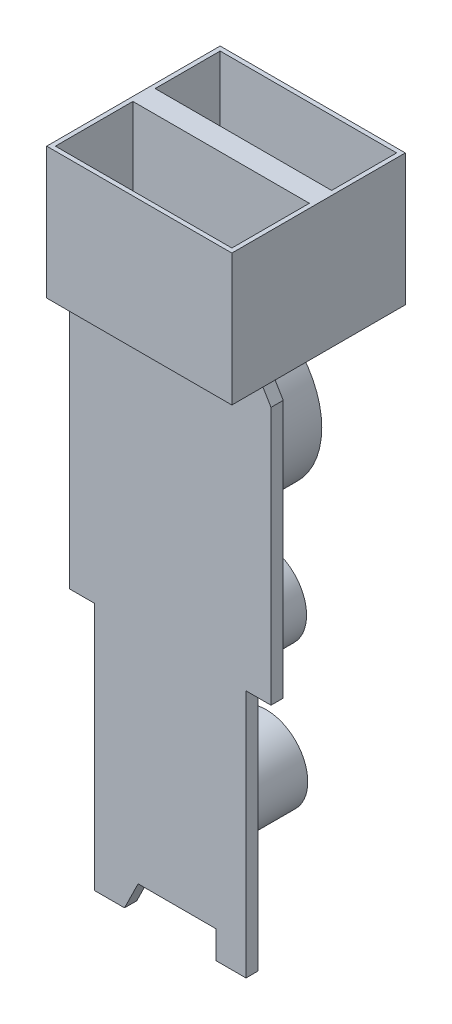
ISO-10303-21;
HEADER;
FILE_DESCRIPTION(('STEP AP214'),'2;1');
FILE_NAME('part.step','',(''),(''),'','','');
FILE_SCHEMA(('AUTOMOTIVE_DESIGN { 1 0 10303 214 1 1 1 1 }'));
ENDSEC;
DATA;
#1=APPLICATION_CONTEXT('core data for automotive mechanical design processes');
#2=APPLICATION_PROTOCOL_DEFINITION('international standard','automotive_design',2000,#1);
#3=PRODUCT_CONTEXT('',#1,'mechanical');
#4=PRODUCT('Part','Part','',(#3));
#5=PRODUCT_RELATED_PRODUCT_CATEGORY('part','',(#4));
#6=PRODUCT_DEFINITION_FORMATION('','',#4);
#7=PRODUCT_DEFINITION_CONTEXT('part definition',#1,'design');
#8=PRODUCT_DEFINITION('design','',#6,#7);
#9=PRODUCT_DEFINITION_SHAPE('','',#8);
#10=(LENGTH_UNIT() NAMED_UNIT(*) SI_UNIT(.MILLI.,.METRE.));
#11=(NAMED_UNIT(*) PLANE_ANGLE_UNIT() SI_UNIT($,.RADIAN.));
#12=(NAMED_UNIT(*) SI_UNIT($,.STERADIAN.) SOLID_ANGLE_UNIT());
#13=UNCERTAINTY_MEASURE_WITH_UNIT(LENGTH_MEASURE(1.E-05),#10,'distance_accuracy_value','');
#14=(GEOMETRIC_REPRESENTATION_CONTEXT(3) GLOBAL_UNCERTAINTY_ASSIGNED_CONTEXT((#13)) GLOBAL_UNIT_ASSIGNED_CONTEXT((#10,
#11,#12)) REPRESENTATION_CONTEXT('',''));
#15=CARTESIAN_POINT('',(0.,0.,0.));
#16=DIRECTION('',(0.,0.,1.));
#17=DIRECTION('',(1.,0.,0.));
#18=AXIS2_PLACEMENT_3D('',#15,#16,#17);
#19=CARTESIAN_POINT('',(0.,-5.,0.));
#20=DIRECTION('',(0.,1.,0.));
#21=DIRECTION('',(0.,0.,1.));
#22=AXIS2_PLACEMENT_3D('',#19,#20,#21);
#23=PLANE('',#22);
#24=DIRECTION('',(-1.,0.,0.));
#25=VECTOR('',#24,1.);
#26=CARTESIAN_POINT('',(-7.03500000000001,-5.,4.23));
#27=LINE('',#26,#25);
#28=CARTESIAN_POINT('',(7.035,-5.,4.23));
#29=VERTEX_POINT('',#28);
#30=CARTESIAN_POINT('',(-7.03500000000001,-5.,4.23));
#31=VERTEX_POINT('',#30);
#32=EDGE_CURVE('E231',#29,#31,#27,.T.);
#33=ORIENTED_EDGE('',*,*,#32,.F.);
#34=DIRECTION('',(0.,0.,-1.));
#35=VECTOR('',#34,1.);
#36=CARTESIAN_POINT('',(7.03499999999999,-5.,-6.59));
#37=LINE('',#36,#35);
#38=CARTESIAN_POINT('',(7.035,-5.,6.59));
#39=VERTEX_POINT('',#38);
#40=EDGE_CURVE('E484',#39,#29,#37,.T.);
#41=ORIENTED_EDGE('',*,*,#40,.F.);
#42=DIRECTION('',(1.,0.,0.));
#43=VECTOR('',#42,1.);
#44=CARTESIAN_POINT('',(-7.03500000000001,-5.,6.59));
#45=LINE('',#44,#43);
#46=CARTESIAN_POINT('',(-7.03500000000001,-5.,6.59));
#47=VERTEX_POINT('',#46);
#48=EDGE_CURVE('E233',#47,#39,#45,.T.);
#49=ORIENTED_EDGE('',*,*,#48,.F.);
#50=DIRECTION('',(0.,0.,1.));
#51=VECTOR('',#50,1.);
#52=CARTESIAN_POINT('',(-7.03500000000001,-5.,-6.59));
#53=LINE('',#52,#51);
#54=EDGE_CURVE('E216',#31,#47,#53,.T.);
#55=ORIENTED_EDGE('',*,*,#54,.F.);
#56=EDGE_LOOP('',(#33,#41,#49,#55));
#57=FACE_BOUND('',#56,.T.);
#58=ADVANCED_FACE('F39',(#57),#23,.F.);
#59=CARTESIAN_POINT('',(7.03499999999999,5.,-6.59));
#60=DIRECTION('',(-1.,0.,0.));
#61=DIRECTION('',(0.,0.,1.));
#62=AXIS2_PLACEMENT_3D('',#59,#60,#61);
#63=PLANE('',#62);
#64=ORIENTED_EDGE('',*,*,#40,.T.);
#65=DIRECTION('',(0.,0.,-1.));
#66=VECTOR('',#65,1.);
#67=CARTESIAN_POINT('',(7.035,-5.,4.23));
#68=LINE('',#67,#66);
#69=CARTESIAN_POINT('',(7.035,-5.,3.3));
#70=VERTEX_POINT('',#69);
#71=EDGE_CURVE('E296',#29,#70,#68,.T.);
#72=ORIENTED_EDGE('',*,*,#71,.T.);
#73=CARTESIAN_POINT('',(7.03499999999999,-5.,-6.59));
#74=VERTEX_POINT('',#73);
#75=EDGE_CURVE('E60',#70,#74,#37,.T.);
#76=ORIENTED_EDGE('',*,*,#75,.T.);
#77=DIRECTION('',(0.,-1.,0.));
#78=VECTOR('',#77,1.);
#79=CARTESIAN_POINT('',(7.03499999999999,5.,-6.59));
#80=LINE('',#79,#78);
#81=CARTESIAN_POINT('',(7.03499999999999,5.,-6.59));
#82=VERTEX_POINT('',#81);
#83=EDGE_CURVE('E11',#82,#74,#80,.T.);
#84=ORIENTED_EDGE('',*,*,#83,.F.);
#85=DIRECTION('',(0.,0.,-1.));
#86=VECTOR('',#85,1.);
#87=CARTESIAN_POINT('',(7.03499999999999,5.,-6.59));
#88=LINE('',#87,#86);
#89=CARTESIAN_POINT('',(7.035,5.,6.59));
#90=VERTEX_POINT('',#89);
#91=EDGE_CURVE('E470',#90,#82,#88,.T.);
#92=ORIENTED_EDGE('',*,*,#91,.F.);
#93=DIRECTION('',(0.,-1.,0.));
#94=VECTOR('',#93,1.);
#95=CARTESIAN_POINT('',(7.035,5.,6.59));
#96=LINE('',#95,#94);
#97=EDGE_CURVE('E483',#90,#39,#96,.T.);
#98=ORIENTED_EDGE('',*,*,#97,.T.);
#99=EDGE_LOOP('',(#64,#72,#76,#84,#92,#98));
#100=FACE_BOUND('',#99,.T.);
#101=ADVANCED_FACE('F41',(#100),#63,.F.);
#102=CARTESIAN_POINT('',(-7.03500000000001,5.,-6.59));
#103=DIRECTION('',(0.,0.,1.));
#104=DIRECTION('',(1.,0.,0.));
#105=AXIS2_PLACEMENT_3D('',#102,#103,#104);
#106=PLANE('',#105);
#107=DIRECTION('',(-1.,0.,0.));
#108=VECTOR('',#107,1.);
#109=CARTESIAN_POINT('',(-7.03500000000001,-5.,-6.59));
#110=LINE('',#109,#108);
#111=CARTESIAN_POINT('',(-7.03500000000001,-5.,-6.59));
#112=VERTEX_POINT('',#111);
#113=EDGE_CURVE('E235',#74,#112,#110,.T.);
#114=ORIENTED_EDGE('',*,*,#113,.T.);
#115=DIRECTION('',(0.,-1.,0.));
#116=VECTOR('',#115,1.);
#117=CARTESIAN_POINT('',(-7.03500000000001,5.,-6.59));
#118=LINE('',#117,#116);
#119=CARTESIAN_POINT('',(-7.03500000000001,5.,-6.59));
#120=VERTEX_POINT('',#119);
#121=EDGE_CURVE('E48',#120,#112,#118,.T.);
#122=ORIENTED_EDGE('',*,*,#121,.F.);
#123=DIRECTION('',(-1.,0.,0.));
#124=VECTOR('',#123,1.);
#125=CARTESIAN_POINT('',(-7.03500000000001,5.,-6.59));
#126=LINE('',#125,#124);
#127=EDGE_CURVE('E474',#82,#120,#126,.T.);
#128=ORIENTED_EDGE('',*,*,#127,.F.);
#129=ORIENTED_EDGE('',*,*,#83,.T.);
#130=EDGE_LOOP('',(#114,#122,#128,#129));
#131=FACE_BOUND('',#130,.T.);
#132=ADVANCED_FACE('F503',(#131),#106,.F.);
#133=CARTESIAN_POINT('',(-7.03500000000001,5.,-6.59));
#134=DIRECTION('',(1.,0.,0.));
#135=DIRECTION('',(0.,0.,-1.));
#136=AXIS2_PLACEMENT_3D('',#133,#134,#135);
#137=PLANE('',#136);
#138=CARTESIAN_POINT('',(-7.03500000000001,-5.,3.3));
#139=VERTEX_POINT('',#138);
#140=EDGE_CURVE('E219',#112,#139,#53,.T.);
#141=ORIENTED_EDGE('',*,*,#140,.T.);
#142=DIRECTION('',(0.,0.,-1.));
#143=VECTOR('',#142,1.);
#144=CARTESIAN_POINT('',(-7.03500000000001,-5.,4.23));
#145=LINE('',#144,#143);
#146=EDGE_CURVE('E212',#31,#139,#145,.T.);
#147=ORIENTED_EDGE('',*,*,#146,.F.);
#148=ORIENTED_EDGE('',*,*,#54,.T.);
#149=DIRECTION('',(0.,-1.,0.));
#150=VECTOR('',#149,1.);
#151=CARTESIAN_POINT('',(-7.03500000000001,5.,6.59));
#152=LINE('',#151,#150);
#153=CARTESIAN_POINT('',(-7.03500000000001,5.,6.59));
#154=VERTEX_POINT('',#153);
#155=EDGE_CURVE('E495',#154,#47,#152,.T.);
#156=ORIENTED_EDGE('',*,*,#155,.F.);
#157=DIRECTION('',(0.,0.,1.));
#158=VECTOR('',#157,1.);
#159=CARTESIAN_POINT('',(-7.03500000000001,5.,-6.59));
#160=LINE('',#159,#158);
#161=EDGE_CURVE('E477',#120,#154,#160,.T.);
#162=ORIENTED_EDGE('',*,*,#161,.F.);
#163=ORIENTED_EDGE('',*,*,#121,.T.);
#164=EDGE_LOOP('',(#141,#147,#148,#156,#162,#163));
#165=FACE_BOUND('',#164,.T.);
#166=ADVANCED_FACE('F214',(#165),#137,.F.);
#167=CARTESIAN_POINT('',(-7.03500000000001,5.,6.59));
#168=DIRECTION('',(0.,0.,-1.));
#169=DIRECTION('',(-1.,0.,0.));
#170=AXIS2_PLACEMENT_3D('',#167,#168,#169);
#171=PLANE('',#170);
#172=ORIENTED_EDGE('',*,*,#48,.T.);
#173=ORIENTED_EDGE('',*,*,#97,.F.);
#174=DIRECTION('',(1.,0.,0.));
#175=VECTOR('',#174,1.);
#176=CARTESIAN_POINT('',(-7.03500000000001,5.,6.59));
#177=LINE('',#176,#175);
#178=EDGE_CURVE('E480',#154,#90,#177,.T.);
#179=ORIENTED_EDGE('',*,*,#178,.F.);
#180=ORIENTED_EDGE('',*,*,#155,.T.);
#181=EDGE_LOOP('',(#172,#173,#179,#180));
#182=FACE_BOUND('',#181,.T.);
#183=ADVANCED_FACE('F591',(#182),#171,.F.);
#184=CARTESIAN_POINT('',(0.,5.,0.));
#185=DIRECTION('',(0.,1.,0.));
#186=DIRECTION('',(0.,0.,1.));
#187=AXIS2_PLACEMENT_3D('',#184,#185,#186);
#188=PLANE('',#187);
#189=DIRECTION('',(0.,0.,1.));
#190=VECTOR('',#189,1.);
#191=CARTESIAN_POINT('',(-6.70500000000001,5.,-6.26));
#192=LINE('',#191,#190);
#193=CARTESIAN_POINT('',(-6.70500000000001,5.,-6.26));
#194=VERTEX_POINT('',#193);
#195=CARTESIAN_POINT('',(-6.70500000000001,5.,-1.32));
#196=VERTEX_POINT('',#195);
#197=EDGE_CURVE('E401',#194,#196,#192,.T.);
#198=ORIENTED_EDGE('',*,*,#197,.F.);
#199=DIRECTION('',(-1.,0.,0.));
#200=VECTOR('',#199,1.);
#201=CARTESIAN_POINT('',(-6.70500000000001,5.,-6.26));
#202=LINE('',#201,#200);
#203=CARTESIAN_POINT('',(6.705,5.,-6.26));
#204=VERTEX_POINT('',#203);
#205=EDGE_CURVE('E388',#204,#194,#202,.T.);
#206=ORIENTED_EDGE('',*,*,#205,.F.);
#207=DIRECTION('',(0.,0.,-1.));
#208=VECTOR('',#207,1.);
#209=CARTESIAN_POINT('',(6.705,5.,-6.26));
#210=LINE('',#209,#208);
#211=CARTESIAN_POINT('',(6.705,5.,-1.32));
#212=VERTEX_POINT('',#211);
#213=EDGE_CURVE('E409',#212,#204,#210,.T.);
#214=ORIENTED_EDGE('',*,*,#213,.F.);
#215=DIRECTION('',(1.,0.,0.));
#216=VECTOR('',#215,1.);
#217=CARTESIAN_POINT('',(-6.70500000000001,5.,-1.32));
#218=LINE('',#217,#216);
#219=EDGE_CURVE('E404',#196,#212,#218,.T.);
#220=ORIENTED_EDGE('',*,*,#219,.F.);
#221=EDGE_LOOP('',(#198,#206,#214,#220));
#222=FACE_BOUND('',#221,.T.);
#223=DIRECTION('',(0.,0.,1.));
#224=VECTOR('',#223,1.);
#225=CARTESIAN_POINT('',(-6.70500000000001,5.,0.371269106661633));
#226=LINE('',#225,#224);
#227=CARTESIAN_POINT('',(-6.70500000000001,5.,0.371269106661633));
#228=VERTEX_POINT('',#227);
#229=CARTESIAN_POINT('',(-6.70500000000001,5.,6.26));
#230=VERTEX_POINT('',#229);
#231=EDGE_CURVE('E224',#228,#230,#226,.T.);
#232=ORIENTED_EDGE('',*,*,#231,.F.);
#233=DIRECTION('',(-1.,0.,0.));
#234=VECTOR('',#233,1.);
#235=CARTESIAN_POINT('',(-6.70500000000001,5.,0.371269106661633));
#236=LINE('',#235,#234);
#237=CARTESIAN_POINT('',(6.70499999999999,5.,0.371269106661633));
#238=VERTEX_POINT('',#237);
#239=EDGE_CURVE('E433',#238,#228,#236,.T.);
#240=ORIENTED_EDGE('',*,*,#239,.F.);
#241=DIRECTION('',(0.,0.,-1.));
#242=VECTOR('',#241,1.);
#243=CARTESIAN_POINT('',(6.70499999999999,5.,0.371269106661633));
#244=LINE('',#243,#242);
#245=CARTESIAN_POINT('',(6.70499999999999,5.,6.26));
#246=VERTEX_POINT('',#245);
#247=EDGE_CURVE('E452',#246,#238,#244,.T.);
#248=ORIENTED_EDGE('',*,*,#247,.F.);
#249=DIRECTION('',(1.,0.,0.));
#250=VECTOR('',#249,1.);
#251=CARTESIAN_POINT('',(-6.70500000000001,5.,6.26));
#252=LINE('',#251,#250);
#253=EDGE_CURVE('E448',#230,#246,#252,.T.);
#254=ORIENTED_EDGE('',*,*,#253,.F.);
#255=EDGE_LOOP('',(#232,#240,#248,#254));
#256=FACE_BOUND('',#255,.T.);
#257=ORIENTED_EDGE('',*,*,#91,.T.);
#258=ORIENTED_EDGE('',*,*,#127,.T.);
#259=ORIENTED_EDGE('',*,*,#161,.T.);
#260=ORIENTED_EDGE('',*,*,#178,.T.);
#261=EDGE_LOOP('',(#257,#258,#259,#260));
#262=FACE_BOUND('',#261,.T.);
#263=ADVANCED_FACE('F583',(#222,#256,#262),#188,.T.);
#264=ORIENTED_EDGE('',*,*,#75,.F.);
#265=DIRECTION('',(-1.,0.,0.));
#266=VECTOR('',#265,1.);
#267=CARTESIAN_POINT('',(-7.03500000000001,-5.,3.3));
#268=LINE('',#267,#266);
#269=EDGE_CURVE('E55',#70,#139,#268,.T.);
#270=ORIENTED_EDGE('',*,*,#269,.T.);
#271=ORIENTED_EDGE('',*,*,#140,.F.);
#272=ORIENTED_EDGE('',*,*,#113,.F.);
#273=EDGE_LOOP('',(#264,#270,#271,#272));
#274=FACE_BOUND('',#273,.T.);
#275=ADVANCED_FACE('F501',(#274),#23,.F.);
#276=CARTESIAN_POINT('',(-6.70500000000001,-4.,0.371269106661633));
#277=DIRECTION('',(-1.,0.,0.));
#278=DIRECTION('',(0.,0.,1.));
#279=AXIS2_PLACEMENT_3D('',#276,#277,#278);
#280=PLANE('',#279);
#281=ORIENTED_EDGE('',*,*,#231,.T.);
#282=DIRECTION('',(0.,1.,0.));
#283=VECTOR('',#282,1.);
#284=CARTESIAN_POINT('',(-6.70500000000001,-4.,6.26));
#285=LINE('',#284,#283);
#286=CARTESIAN_POINT('',(-6.70500000000001,-4.,6.26));
#287=VERTEX_POINT('',#286);
#288=EDGE_CURVE('E445',#287,#230,#285,.T.);
#289=ORIENTED_EDGE('',*,*,#288,.F.);
#290=DIRECTION('',(0.,0.,1.));
#291=VECTOR('',#290,1.);
#292=CARTESIAN_POINT('',(-6.70500000000001,-4.,0.371269106661633));
#293=LINE('',#292,#291);
#294=CARTESIAN_POINT('',(-6.70500000000001,-4.,0.371269106661633));
#295=VERTEX_POINT('',#294);
#296=EDGE_CURVE('E428',#295,#287,#293,.T.);
#297=ORIENTED_EDGE('',*,*,#296,.F.);
#298=DIRECTION('',(0.,1.,0.));
#299=VECTOR('',#298,1.);
#300=CARTESIAN_POINT('',(-6.70500000000001,-4.,0.371269106661633));
#301=LINE('',#300,#299);
#302=EDGE_CURVE('E405',#295,#228,#301,.T.);
#303=ORIENTED_EDGE('',*,*,#302,.T.);
#304=EDGE_LOOP('',(#281,#289,#297,#303));
#305=FACE_BOUND('',#304,.T.);
#306=ADVANCED_FACE('F582',(#305),#280,.F.);
#307=CARTESIAN_POINT('',(-6.70500000000001,-4.,0.371269106661633));
#308=DIRECTION('',(0.,0.,-1.));
#309=DIRECTION('',(-1.,0.,0.));
#310=AXIS2_PLACEMENT_3D('',#307,#308,#309);
#311=PLANE('',#310);
#312=ORIENTED_EDGE('',*,*,#239,.T.);
#313=ORIENTED_EDGE('',*,*,#302,.F.);
#314=DIRECTION('',(-1.,0.,0.));
#315=VECTOR('',#314,1.);
#316=CARTESIAN_POINT('',(-6.70500000000001,-4.,0.371269106661633));
#317=LINE('',#316,#315);
#318=CARTESIAN_POINT('',(6.70499999999999,-4.,0.371269106661633));
#319=VERTEX_POINT('',#318);
#320=EDGE_CURVE('E441',#319,#295,#317,.T.);
#321=ORIENTED_EDGE('',*,*,#320,.F.);
#322=DIRECTION('',(0.,1.,0.));
#323=VECTOR('',#322,1.);
#324=CARTESIAN_POINT('',(6.70499999999999,-4.,0.371269106661633));
#325=LINE('',#324,#323);
#326=EDGE_CURVE('E461',#319,#238,#325,.T.);
#327=ORIENTED_EDGE('',*,*,#326,.T.);
#328=EDGE_LOOP('',(#312,#313,#321,#327));
#329=FACE_BOUND('',#328,.T.);
#330=ADVANCED_FACE('F588',(#329),#311,.F.);
#331=CARTESIAN_POINT('',(6.70499999999999,-4.,0.371269106661633));
#332=DIRECTION('',(1.,0.,0.));
#333=DIRECTION('',(0.,0.,-1.));
#334=AXIS2_PLACEMENT_3D('',#331,#332,#333);
#335=PLANE('',#334);
#336=ORIENTED_EDGE('',*,*,#247,.T.);
#337=ORIENTED_EDGE('',*,*,#326,.F.);
#338=DIRECTION('',(0.,0.,-1.));
#339=VECTOR('',#338,1.);
#340=CARTESIAN_POINT('',(6.70499999999999,-4.,0.371269106661633));
#341=LINE('',#340,#339);
#342=CARTESIAN_POINT('',(6.70499999999999,-4.,6.26));
#343=VERTEX_POINT('',#342);
#344=EDGE_CURVE('E437',#343,#319,#341,.T.);
#345=ORIENTED_EDGE('',*,*,#344,.F.);
#346=DIRECTION('',(0.,1.,0.));
#347=VECTOR('',#346,1.);
#348=CARTESIAN_POINT('',(6.70499999999999,-4.,6.26));
#349=LINE('',#348,#347);
#350=EDGE_CURVE('E464',#343,#246,#349,.T.);
#351=ORIENTED_EDGE('',*,*,#350,.T.);
#352=EDGE_LOOP('',(#336,#337,#345,#351));
#353=FACE_BOUND('',#352,.T.);
#354=ADVANCED_FACE('F604',(#353),#335,.F.);
#355=CARTESIAN_POINT('',(-6.70500000000001,-4.,6.26));
#356=DIRECTION('',(0.,0.,1.));
#357=DIRECTION('',(1.,0.,0.));
#358=AXIS2_PLACEMENT_3D('',#355,#356,#357);
#359=PLANE('',#358);
#360=ORIENTED_EDGE('',*,*,#253,.T.);
#361=ORIENTED_EDGE('',*,*,#350,.F.);
#362=DIRECTION('',(1.,0.,0.));
#363=VECTOR('',#362,1.);
#364=CARTESIAN_POINT('',(-6.70500000000001,-4.,6.26));
#365=LINE('',#364,#363);
#366=EDGE_CURVE('E432',#287,#343,#365,.T.);
#367=ORIENTED_EDGE('',*,*,#366,.F.);
#368=ORIENTED_EDGE('',*,*,#288,.T.);
#369=EDGE_LOOP('',(#360,#361,#367,#368));
#370=FACE_BOUND('',#369,.T.);
#371=ADVANCED_FACE('F600',(#370),#359,.F.);
#372=CARTESIAN_POINT('',(0.,-4.,0.));
#373=DIRECTION('',(0.,1.,0.));
#374=DIRECTION('',(0.,0.,1.));
#375=AXIS2_PLACEMENT_3D('',#372,#373,#374);
#376=PLANE('',#375);
#377=ORIENTED_EDGE('',*,*,#296,.T.);
#378=ORIENTED_EDGE('',*,*,#366,.T.);
#379=ORIENTED_EDGE('',*,*,#344,.T.);
#380=ORIENTED_EDGE('',*,*,#320,.T.);
#381=EDGE_LOOP('',(#377,#378,#379,#380));
#382=FACE_BOUND('',#381,.T.);
#383=ADVANCED_FACE('F603',(#382),#376,.T.);
#384=CARTESIAN_POINT('',(-6.70500000000001,-4.,-6.26));
#385=DIRECTION('',(-1.,0.,0.));
#386=DIRECTION('',(0.,0.,1.));
#387=AXIS2_PLACEMENT_3D('',#384,#385,#386);
#388=PLANE('',#387);
#389=ORIENTED_EDGE('',*,*,#197,.T.);
#390=DIRECTION('',(0.,1.,0.));
#391=VECTOR('',#390,1.);
#392=CARTESIAN_POINT('',(-6.70500000000001,-4.,-1.32));
#393=LINE('',#392,#391);
#394=CARTESIAN_POINT('',(-6.70500000000001,-4.,-1.32));
#395=VERTEX_POINT('',#394);
#396=EDGE_CURVE('E400',#395,#196,#393,.T.);
#397=ORIENTED_EDGE('',*,*,#396,.F.);
#398=DIRECTION('',(0.,0.,1.));
#399=VECTOR('',#398,1.);
#400=CARTESIAN_POINT('',(-6.70500000000001,-4.,-6.26));
#401=LINE('',#400,#399);
#402=CARTESIAN_POINT('',(-6.70500000000001,-4.,-6.26));
#403=VERTEX_POINT('',#402);
#404=EDGE_CURVE('E383',#403,#395,#401,.T.);
#405=ORIENTED_EDGE('',*,*,#404,.F.);
#406=DIRECTION('',(0.,1.,0.));
#407=VECTOR('',#406,1.);
#408=CARTESIAN_POINT('',(-6.70500000000001,-4.,-6.26));
#409=LINE('',#408,#407);
#410=EDGE_CURVE('E416',#403,#194,#409,.T.);
#411=ORIENTED_EDGE('',*,*,#410,.T.);
#412=EDGE_LOOP('',(#389,#397,#405,#411));
#413=FACE_BOUND('',#412,.T.);
#414=ADVANCED_FACE('F614',(#413),#388,.F.);
#415=CARTESIAN_POINT('',(-6.70500000000001,-4.,-6.26));
#416=DIRECTION('',(0.,0.,-1.));
#417=DIRECTION('',(-1.,0.,0.));
#418=AXIS2_PLACEMENT_3D('',#415,#416,#417);
#419=PLANE('',#418);
#420=ORIENTED_EDGE('',*,*,#205,.T.);
#421=ORIENTED_EDGE('',*,*,#410,.F.);
#422=DIRECTION('',(-1.,0.,0.));
#423=VECTOR('',#422,1.);
#424=CARTESIAN_POINT('',(-6.70500000000001,-4.,-6.26));
#425=LINE('',#424,#423);
#426=CARTESIAN_POINT('',(6.705,-4.,-6.26));
#427=VERTEX_POINT('',#426);
#428=EDGE_CURVE('E396',#427,#403,#425,.T.);
#429=ORIENTED_EDGE('',*,*,#428,.F.);
#430=DIRECTION('',(0.,1.,0.));
#431=VECTOR('',#430,1.);
#432=CARTESIAN_POINT('',(6.705,-4.,-6.26));
#433=LINE('',#432,#431);
#434=EDGE_CURVE('E419',#427,#204,#433,.T.);
#435=ORIENTED_EDGE('',*,*,#434,.T.);
#436=EDGE_LOOP('',(#420,#421,#429,#435));
#437=FACE_BOUND('',#436,.T.);
#438=ADVANCED_FACE('F618',(#437),#419,.F.);
#439=CARTESIAN_POINT('',(6.705,-4.,-6.26));
#440=DIRECTION('',(1.,0.,0.));
#441=DIRECTION('',(0.,0.,-1.));
#442=AXIS2_PLACEMENT_3D('',#439,#440,#441);
#443=PLANE('',#442);
#444=ORIENTED_EDGE('',*,*,#213,.T.);
#445=ORIENTED_EDGE('',*,*,#434,.F.);
#446=DIRECTION('',(0.,0.,-1.));
#447=VECTOR('',#446,1.);
#448=CARTESIAN_POINT('',(6.705,-4.,-6.26));
#449=LINE('',#448,#447);
#450=CARTESIAN_POINT('',(6.705,-4.,-1.32));
#451=VERTEX_POINT('',#450);
#452=EDGE_CURVE('E392',#451,#427,#449,.T.);
#453=ORIENTED_EDGE('',*,*,#452,.F.);
#454=DIRECTION('',(0.,1.,0.));
#455=VECTOR('',#454,1.);
#456=CARTESIAN_POINT('',(6.705,-4.,-1.32));
#457=LINE('',#456,#455);
#458=EDGE_CURVE('E422',#451,#212,#457,.T.);
#459=ORIENTED_EDGE('',*,*,#458,.T.);
#460=EDGE_LOOP('',(#444,#445,#453,#459));
#461=FACE_BOUND('',#460,.T.);
#462=ADVANCED_FACE('F624',(#461),#443,.F.);
#463=CARTESIAN_POINT('',(-6.70500000000001,-4.,-1.32));
#464=DIRECTION('',(0.,0.,1.));
#465=DIRECTION('',(1.,0.,0.));
#466=AXIS2_PLACEMENT_3D('',#463,#464,#465);
#467=PLANE('',#466);
#468=ORIENTED_EDGE('',*,*,#219,.T.);
#469=ORIENTED_EDGE('',*,*,#458,.F.);
#470=DIRECTION('',(1.,0.,0.));
#471=VECTOR('',#470,1.);
#472=CARTESIAN_POINT('',(-6.70500000000001,-4.,-1.32));
#473=LINE('',#472,#471);
#474=EDGE_CURVE('E387',#395,#451,#473,.T.);
#475=ORIENTED_EDGE('',*,*,#474,.F.);
#476=ORIENTED_EDGE('',*,*,#396,.T.);
#477=EDGE_LOOP('',(#468,#469,#475,#476));
#478=FACE_BOUND('',#477,.T.);
#479=ADVANCED_FACE('F620',(#478),#467,.F.);
#480=CARTESIAN_POINT('',(0.,-4.,0.));
#481=DIRECTION('',(0.,1.,0.));
#482=DIRECTION('',(0.,0.,1.));
#483=AXIS2_PLACEMENT_3D('',#480,#481,#482);
#484=PLANE('',#483);
#485=ORIENTED_EDGE('',*,*,#404,.T.);
#486=ORIENTED_EDGE('',*,*,#474,.T.);
#487=ORIENTED_EDGE('',*,*,#452,.T.);
#488=ORIENTED_EDGE('',*,*,#428,.T.);
#489=EDGE_LOOP('',(#485,#486,#487,#488));
#490=FACE_BOUND('',#489,.T.);
#491=ADVANCED_FACE('F623',(#490),#484,.T.);
#492=CARTESIAN_POINT('',(-7.65000000000002,-6.03042466973574,4.23));
#493=DIRECTION('',(0.858687224779778,-0.512500000000003,0.));
#494=DIRECTION('',(0.512500000000003,0.858687224779778,0.));
#495=AXIS2_PLACEMENT_3D('',#492,#493,#494);
#496=PLANE('',#495);
#497=DIRECTION('',(-0.512500000000003,-0.858687224779778,0.));
#498=VECTOR('',#497,1.);
#499=CARTESIAN_POINT('',(-7.65000000000002,-6.03042466973574,3.3));
#500=LINE('',#499,#498);
#501=CARTESIAN_POINT('',(-7.65000000000002,-6.03042466973574,3.3));
#502=VERTEX_POINT('',#501);
#503=EDGE_CURVE('E299',#139,#502,#500,.T.);
#504=ORIENTED_EDGE('',*,*,#503,.T.);
#505=DIRECTION('',(0.,0.,-1.));
#506=VECTOR('',#505,1.);
#507=CARTESIAN_POINT('',(-7.65000000000002,-6.03042466973574,4.23));
#508=LINE('',#507,#506);
#509=CARTESIAN_POINT('',(-7.65000000000002,-6.03042466973574,4.23));
#510=VERTEX_POINT('',#509);
#511=EDGE_CURVE('E225',#510,#502,#508,.T.);
#512=ORIENTED_EDGE('',*,*,#511,.F.);
#513=DIRECTION('',(-0.512500000000003,-0.858687224779778,0.));
#514=VECTOR('',#513,1.);
#515=CARTESIAN_POINT('',(-7.65000000000002,-6.03042466973574,4.23));
#516=LINE('',#515,#514);
#517=EDGE_CURVE('E238',#31,#510,#516,.T.);
#518=ORIENTED_EDGE('',*,*,#517,.F.);
#519=ORIENTED_EDGE('',*,*,#146,.T.);
#520=EDGE_LOOP('',(#504,#512,#518,#519));
#521=FACE_BOUND('',#520,.T.);
#522=ADVANCED_FACE('F239',(#521),#496,.F.);
#523=CARTESIAN_POINT('',(-7.65000000000002,-6.03042466973574,4.23));
#524=DIRECTION('',(1.,0.,0.));
#525=DIRECTION('',(0.,1.,0.));
#526=AXIS2_PLACEMENT_3D('',#523,#524,#525);
#527=PLANE('',#526);
#528=DIRECTION('',(0.,-1.,0.));
#529=VECTOR('',#528,1.);
#530=CARTESIAN_POINT('',(-7.65000000000002,-6.03042466973574,3.3));
#531=LINE('',#530,#529);
#532=CARTESIAN_POINT('',(-7.65,-25.6304246697357,3.3));
#533=VERTEX_POINT('',#532);
#534=EDGE_CURVE('E303',#502,#533,#531,.T.);
#535=ORIENTED_EDGE('',*,*,#534,.T.);
#536=DIRECTION('',(0.,0.,-1.));
#537=VECTOR('',#536,1.);
#538=CARTESIAN_POINT('',(-7.65,-25.6304246697357,4.23));
#539=LINE('',#538,#537);
#540=CARTESIAN_POINT('',(-7.65,-25.6304246697357,4.23));
#541=VERTEX_POINT('',#540);
#542=EDGE_CURVE('E377',#541,#533,#539,.T.);
#543=ORIENTED_EDGE('',*,*,#542,.F.);
#544=DIRECTION('',(0.,-1.,0.));
#545=VECTOR('',#544,1.);
#546=CARTESIAN_POINT('',(-7.65000000000002,-6.03042466973574,4.23));
#547=LINE('',#546,#545);
#548=EDGE_CURVE('E244',#510,#541,#547,.T.);
#549=ORIENTED_EDGE('',*,*,#548,.F.);
#550=ORIENTED_EDGE('',*,*,#511,.T.);
#551=EDGE_LOOP('',(#535,#543,#549,#550));
#552=FACE_BOUND('',#551,.T.);
#553=ADVANCED_FACE('F517',(#552),#527,.F.);
#554=CARTESIAN_POINT('',(-7.65,-25.6304246697357,4.23));
#555=DIRECTION('',(0.,1.,0.));
#556=DIRECTION('',(0.,0.,1.));
#557=AXIS2_PLACEMENT_3D('',#554,#555,#556);
#558=PLANE('',#557);
#559=DIRECTION('',(1.,0.,0.));
#560=VECTOR('',#559,1.);
#561=CARTESIAN_POINT('',(-7.65,-25.6304246697357,3.3));
#562=LINE('',#561,#560);
#563=CARTESIAN_POINT('',(-5.75000000000004,-25.6304246697357,3.3));
#564=VERTEX_POINT('',#563);
#565=EDGE_CURVE('E306',#533,#564,#562,.T.);
#566=ORIENTED_EDGE('',*,*,#565,.T.);
#567=DIRECTION('',(0.,0.,-1.));
#568=VECTOR('',#567,1.);
#569=CARTESIAN_POINT('',(-5.75000000000004,-25.6304246697357,4.23));
#570=LINE('',#569,#568);
#571=CARTESIAN_POINT('',(-5.75000000000004,-25.6304246697357,4.23));
#572=VERTEX_POINT('',#571);
#573=EDGE_CURVE('E373',#572,#564,#570,.T.);
#574=ORIENTED_EDGE('',*,*,#573,.F.);
#575=DIRECTION('',(1.,0.,0.));
#576=VECTOR('',#575,1.);
#577=CARTESIAN_POINT('',(-7.65,-25.6304246697357,4.23));
#578=LINE('',#577,#576);
#579=EDGE_CURVE('E264',#541,#572,#578,.T.);
#580=ORIENTED_EDGE('',*,*,#579,.F.);
#581=ORIENTED_EDGE('',*,*,#542,.T.);
#582=EDGE_LOOP('',(#566,#574,#580,#581));
#583=FACE_BOUND('',#582,.T.);
#584=ADVANCED_FACE('F524',(#583),#558,.F.);
#585=CARTESIAN_POINT('',(-5.75000000000004,-25.6304246697357,4.23));
#586=DIRECTION('',(1.,0.,0.));
#587=DIRECTION('',(0.,1.,0.));
#588=AXIS2_PLACEMENT_3D('',#585,#586,#587);
#589=PLANE('',#588);
#590=DIRECTION('',(0.,-1.,0.));
#591=VECTOR('',#590,1.);
#592=CARTESIAN_POINT('',(-5.75000000000004,-25.6304246697357,3.3));
#593=LINE('',#592,#591);
#594=CARTESIAN_POINT('',(-5.74999999999999,-44.5304246697357,3.3));
#595=VERTEX_POINT('',#594);
#596=EDGE_CURVE('E309',#564,#595,#593,.T.);
#597=ORIENTED_EDGE('',*,*,#596,.T.);
#598=DIRECTION('',(0.,0.,-1.));
#599=VECTOR('',#598,1.);
#600=CARTESIAN_POINT('',(-5.74999999999999,-44.5304246697357,4.23));
#601=LINE('',#600,#599);
#602=CARTESIAN_POINT('',(-5.74999999999999,-44.5304246697357,4.23));
#603=VERTEX_POINT('',#602);
#604=EDGE_CURVE('E369',#603,#595,#601,.T.);
#605=ORIENTED_EDGE('',*,*,#604,.F.);
#606=DIRECTION('',(0.,-1.,0.));
#607=VECTOR('',#606,1.);
#608=CARTESIAN_POINT('',(-5.75000000000004,-25.6304246697357,4.23));
#609=LINE('',#608,#607);
#610=EDGE_CURVE('E267',#572,#603,#609,.T.);
#611=ORIENTED_EDGE('',*,*,#610,.F.);
#612=ORIENTED_EDGE('',*,*,#573,.T.);
#613=EDGE_LOOP('',(#597,#605,#611,#612));
#614=FACE_BOUND('',#613,.T.);
#615=ADVANCED_FACE('F527',(#614),#589,.F.);
#616=CARTESIAN_POINT('',(-5.74999999999999,-44.5304246697357,4.23));
#617=DIRECTION('',(0.,1.,0.));
#618=DIRECTION('',(-1.,0.,0.));
#619=AXIS2_PLACEMENT_3D('',#616,#617,#618);
#620=PLANE('',#619);
#621=DIRECTION('',(1.,0.,0.));
#622=VECTOR('',#621,1.);
#623=CARTESIAN_POINT('',(-5.74999999999999,-44.5304246697357,3.3));
#624=LINE('',#623,#622);
#625=CARTESIAN_POINT('',(-3.48,-44.5304246697357,3.3));
#626=VERTEX_POINT('',#625);
#627=EDGE_CURVE('E312',#595,#626,#624,.T.);
#628=ORIENTED_EDGE('',*,*,#627,.T.);
#629=DIRECTION('',(0.,0.,-1.));
#630=VECTOR('',#629,1.);
#631=CARTESIAN_POINT('',(-3.48,-44.5304246697357,4.23));
#632=LINE('',#631,#630);
#633=CARTESIAN_POINT('',(-3.48,-44.5304246697357,4.23));
#634=VERTEX_POINT('',#633);
#635=EDGE_CURVE('E365',#634,#626,#632,.T.);
#636=ORIENTED_EDGE('',*,*,#635,.F.);
#637=DIRECTION('',(1.,0.,0.));
#638=VECTOR('',#637,1.);
#639=CARTESIAN_POINT('',(-5.74999999999999,-44.5304246697357,4.23));
#640=LINE('',#639,#638);
#641=EDGE_CURVE('E270',#603,#634,#640,.T.);
#642=ORIENTED_EDGE('',*,*,#641,.F.);
#643=ORIENTED_EDGE('',*,*,#604,.T.);
#644=EDGE_LOOP('',(#628,#636,#642,#643));
#645=FACE_BOUND('',#644,.T.);
#646=ADVANCED_FACE('F532',(#645),#620,.F.);
#647=CARTESIAN_POINT('',(-3.48,-44.5304246697357,4.23));
#648=DIRECTION('',(-0.897646734433403,0.440715713539974,0.));
#649=DIRECTION('',(-0.440715713539974,-0.897646734433403,0.));
#650=AXIS2_PLACEMENT_3D('',#647,#648,#649);
#651=PLANE('',#650);
#652=DIRECTION('',(0.440715713539974,0.897646734433403,0.));
#653=VECTOR('',#652,1.);
#654=CARTESIAN_POINT('',(-3.48,-44.5304246697357,3.3));
#655=LINE('',#654,#653);
#656=CARTESIAN_POINT('',(-2.44896745352937,-42.4304246697357,3.3));
#657=VERTEX_POINT('',#656);
#658=EDGE_CURVE('E315',#626,#657,#655,.T.);
#659=ORIENTED_EDGE('',*,*,#658,.T.);
#660=DIRECTION('',(0.,0.,-1.));
#661=VECTOR('',#660,1.);
#662=CARTESIAN_POINT('',(-2.44896745352937,-42.4304246697357,4.23));
#663=LINE('',#662,#661);
#664=CARTESIAN_POINT('',(-2.44896745352937,-42.4304246697357,4.23));
#665=VERTEX_POINT('',#664);
#666=EDGE_CURVE('E361',#665,#657,#663,.T.);
#667=ORIENTED_EDGE('',*,*,#666,.F.);
#668=DIRECTION('',(0.440715713539974,0.897646734433403,0.));
#669=VECTOR('',#668,1.);
#670=CARTESIAN_POINT('',(-3.48,-44.5304246697357,4.23));
#671=LINE('',#670,#669);
#672=EDGE_CURVE('E273',#634,#665,#671,.T.);
#673=ORIENTED_EDGE('',*,*,#672,.F.);
#674=ORIENTED_EDGE('',*,*,#635,.T.);
#675=EDGE_LOOP('',(#659,#667,#673,#674));
#676=FACE_BOUND('',#675,.T.);
#677=ADVANCED_FACE('F538',(#676),#651,.F.);
#678=CARTESIAN_POINT('',(3.48,-42.4304246697358,4.23));
#679=DIRECTION('',(0.,1.,0.));
#680=DIRECTION('',(-1.,0.,0.));
#681=AXIS2_PLACEMENT_3D('',#678,#679,#680);
#682=PLANE('',#681);
#683=DIRECTION('',(1.,0.,0.));
#684=VECTOR('',#683,1.);
#685=CARTESIAN_POINT('',(3.48,-42.4304246697358,3.3));
#686=LINE('',#685,#684);
#687=CARTESIAN_POINT('',(3.48,-42.4304246697358,3.3));
#688=VERTEX_POINT('',#687);
#689=EDGE_CURVE('E318',#657,#688,#686,.T.);
#690=ORIENTED_EDGE('',*,*,#689,.T.);
#691=DIRECTION('',(0.,0.,-1.));
#692=VECTOR('',#691,1.);
#693=CARTESIAN_POINT('',(3.48,-42.4304246697358,4.23));
#694=LINE('',#693,#692);
#695=CARTESIAN_POINT('',(3.48,-42.4304246697358,4.23));
#696=VERTEX_POINT('',#695);
#697=EDGE_CURVE('E357',#696,#688,#694,.T.);
#698=ORIENTED_EDGE('',*,*,#697,.F.);
#699=DIRECTION('',(1.,0.,0.));
#700=VECTOR('',#699,1.);
#701=CARTESIAN_POINT('',(3.48,-42.4304246697358,4.23));
#702=LINE('',#701,#700);
#703=EDGE_CURVE('E276',#665,#696,#702,.T.);
#704=ORIENTED_EDGE('',*,*,#703,.F.);
#705=ORIENTED_EDGE('',*,*,#666,.T.);
#706=EDGE_LOOP('',(#690,#698,#704,#705));
#707=FACE_BOUND('',#706,.T.);
#708=ADVANCED_FACE('F542',(#707),#682,.F.);
#709=CARTESIAN_POINT('',(3.48000000000001,-44.5304246697358,4.23));
#710=DIRECTION('',(1.,0.,0.));
#711=DIRECTION('',(0.,1.,0.));
#712=AXIS2_PLACEMENT_3D('',#709,#710,#711);
#713=PLANE('',#712);
#714=DIRECTION('',(0.,-1.,0.));
#715=VECTOR('',#714,1.);
#716=CARTESIAN_POINT('',(3.48000000000001,-44.5304246697358,3.3));
#717=LINE('',#716,#715);
#718=CARTESIAN_POINT('',(3.48000000000001,-44.5304246697358,3.3));
#719=VERTEX_POINT('',#718);
#720=EDGE_CURVE('E321',#688,#719,#717,.T.);
#721=ORIENTED_EDGE('',*,*,#720,.T.);
#722=DIRECTION('',(0.,0.,-1.));
#723=VECTOR('',#722,1.);
#724=CARTESIAN_POINT('',(3.48000000000001,-44.5304246697358,4.23));
#725=LINE('',#724,#723);
#726=CARTESIAN_POINT('',(3.48000000000001,-44.5304246697358,4.23));
#727=VERTEX_POINT('',#726);
#728=EDGE_CURVE('E353',#727,#719,#725,.T.);
#729=ORIENTED_EDGE('',*,*,#728,.F.);
#730=DIRECTION('',(0.,-1.,0.));
#731=VECTOR('',#730,1.);
#732=CARTESIAN_POINT('',(3.48000000000001,-44.5304246697358,4.23));
#733=LINE('',#732,#731);
#734=EDGE_CURVE('E279',#696,#727,#733,.T.);
#735=ORIENTED_EDGE('',*,*,#734,.F.);
#736=ORIENTED_EDGE('',*,*,#697,.T.);
#737=EDGE_LOOP('',(#721,#729,#735,#736));
#738=FACE_BOUND('',#737,.T.);
#739=ADVANCED_FACE('F547',(#738),#713,.F.);
#740=CARTESIAN_POINT('',(5.75000000000001,-44.5304246697357,4.23));
#741=DIRECTION('',(0.,1.,0.));
#742=DIRECTION('',(-1.,0.,0.));
#743=AXIS2_PLACEMENT_3D('',#740,#741,#742);
#744=PLANE('',#743);
#745=DIRECTION('',(1.,0.,0.));
#746=VECTOR('',#745,1.);
#747=CARTESIAN_POINT('',(5.75000000000001,-44.5304246697357,3.3));
#748=LINE('',#747,#746);
#749=CARTESIAN_POINT('',(5.75000000000001,-44.5304246697357,3.3));
#750=VERTEX_POINT('',#749);
#751=EDGE_CURVE('E324',#719,#750,#748,.T.);
#752=ORIENTED_EDGE('',*,*,#751,.T.);
#753=DIRECTION('',(0.,0.,-1.));
#754=VECTOR('',#753,1.);
#755=CARTESIAN_POINT('',(5.75000000000001,-44.5304246697357,4.23));
#756=LINE('',#755,#754);
#757=CARTESIAN_POINT('',(5.75000000000001,-44.5304246697357,4.23));
#758=VERTEX_POINT('',#757);
#759=EDGE_CURVE('E349',#758,#750,#756,.T.);
#760=ORIENTED_EDGE('',*,*,#759,.F.);
#761=DIRECTION('',(1.,0.,0.));
#762=VECTOR('',#761,1.);
#763=CARTESIAN_POINT('',(5.75000000000001,-44.5304246697357,4.23));
#764=LINE('',#763,#762);
#765=EDGE_CURVE('E282',#727,#758,#764,.T.);
#766=ORIENTED_EDGE('',*,*,#765,.F.);
#767=ORIENTED_EDGE('',*,*,#728,.T.);
#768=EDGE_LOOP('',(#752,#760,#766,#767));
#769=FACE_BOUND('',#768,.T.);
#770=ADVANCED_FACE('F553',(#769),#744,.F.);
#771=CARTESIAN_POINT('',(5.75,-25.6304246697357,4.23));
#772=DIRECTION('',(-1.,0.,0.));
#773=DIRECTION('',(0.,-1.,0.));
#774=AXIS2_PLACEMENT_3D('',#771,#772,#773);
#775=PLANE('',#774);
#776=DIRECTION('',(0.,1.,0.));
#777=VECTOR('',#776,1.);
#778=CARTESIAN_POINT('',(5.75,-25.6304246697357,3.3));
#779=LINE('',#778,#777);
#780=CARTESIAN_POINT('',(5.75,-25.6304246697357,3.3));
#781=VERTEX_POINT('',#780);
#782=EDGE_CURVE('E327',#750,#781,#779,.T.);
#783=ORIENTED_EDGE('',*,*,#782,.T.);
#784=DIRECTION('',(0.,0.,-1.));
#785=VECTOR('',#784,1.);
#786=CARTESIAN_POINT('',(5.75,-25.6304246697357,4.23));
#787=LINE('',#786,#785);
#788=CARTESIAN_POINT('',(5.75,-25.6304246697357,4.23));
#789=VERTEX_POINT('',#788);
#790=EDGE_CURVE('E345',#789,#781,#787,.T.);
#791=ORIENTED_EDGE('',*,*,#790,.F.);
#792=DIRECTION('',(0.,1.,0.));
#793=VECTOR('',#792,1.);
#794=CARTESIAN_POINT('',(5.75,-25.6304246697357,4.23));
#795=LINE('',#794,#793);
#796=EDGE_CURVE('E285',#758,#789,#795,.T.);
#797=ORIENTED_EDGE('',*,*,#796,.F.);
#798=ORIENTED_EDGE('',*,*,#759,.T.);
#799=EDGE_LOOP('',(#783,#791,#797,#798));
#800=FACE_BOUND('',#799,.T.);
#801=ADVANCED_FACE('F557',(#800),#775,.F.);
#802=CARTESIAN_POINT('',(7.65,-25.6304246697357,4.23));
#803=DIRECTION('',(0.,1.,0.));
#804=DIRECTION('',(-1.,0.,0.));
#805=AXIS2_PLACEMENT_3D('',#802,#803,#804);
#806=PLANE('',#805);
#807=DIRECTION('',(1.,0.,0.));
#808=VECTOR('',#807,1.);
#809=CARTESIAN_POINT('',(7.65,-25.6304246697357,3.3));
#810=LINE('',#809,#808);
#811=CARTESIAN_POINT('',(7.65,-25.6304246697357,3.3));
#812=VERTEX_POINT('',#811);
#813=EDGE_CURVE('E330',#781,#812,#810,.T.);
#814=ORIENTED_EDGE('',*,*,#813,.T.);
#815=DIRECTION('',(0.,0.,-1.));
#816=VECTOR('',#815,1.);
#817=CARTESIAN_POINT('',(7.65,-25.6304246697357,4.23));
#818=LINE('',#817,#816);
#819=CARTESIAN_POINT('',(7.65,-25.6304246697357,4.23));
#820=VERTEX_POINT('',#819);
#821=EDGE_CURVE('E341',#820,#812,#818,.T.);
#822=ORIENTED_EDGE('',*,*,#821,.F.);
#823=DIRECTION('',(1.,0.,0.));
#824=VECTOR('',#823,1.);
#825=CARTESIAN_POINT('',(7.65,-25.6304246697357,4.23));
#826=LINE('',#825,#824);
#827=EDGE_CURVE('E288',#789,#820,#826,.T.);
#828=ORIENTED_EDGE('',*,*,#827,.F.);
#829=ORIENTED_EDGE('',*,*,#790,.T.);
#830=EDGE_LOOP('',(#814,#822,#828,#829));
#831=FACE_BOUND('',#830,.T.);
#832=ADVANCED_FACE('F562',(#831),#806,.F.);
#833=CARTESIAN_POINT('',(7.65,-6.03042466973573,4.23));
#834=DIRECTION('',(-1.,0.,0.));
#835=DIRECTION('',(0.,-1.,0.));
#836=AXIS2_PLACEMENT_3D('',#833,#834,#835);
#837=PLANE('',#836);
#838=DIRECTION('',(0.,1.,0.));
#839=VECTOR('',#838,1.);
#840=CARTESIAN_POINT('',(7.65,-6.03042466973573,3.3));
#841=LINE('',#840,#839);
#842=CARTESIAN_POINT('',(7.65,-6.03042466973573,3.3));
#843=VERTEX_POINT('',#842);
#844=EDGE_CURVE('E256',#812,#843,#841,.T.);
#845=ORIENTED_EDGE('',*,*,#844,.T.);
#846=DIRECTION('',(0.,0.,-1.));
#847=VECTOR('',#846,1.);
#848=CARTESIAN_POINT('',(7.65,-6.03042466973573,4.23));
#849=LINE('',#848,#847);
#850=CARTESIAN_POINT('',(7.65,-6.03042466973573,4.23));
#851=VERTEX_POINT('',#850);
#852=EDGE_CURVE('E337',#851,#843,#849,.T.);
#853=ORIENTED_EDGE('',*,*,#852,.F.);
#854=DIRECTION('',(0.,1.,0.));
#855=VECTOR('',#854,1.);
#856=CARTESIAN_POINT('',(7.65,-6.03042466973573,4.23));
#857=LINE('',#856,#855);
#858=EDGE_CURVE('E291',#820,#851,#857,.T.);
#859=ORIENTED_EDGE('',*,*,#858,.F.);
#860=ORIENTED_EDGE('',*,*,#821,.T.);
#861=EDGE_LOOP('',(#845,#853,#859,#860));
#862=FACE_BOUND('',#861,.T.);
#863=ADVANCED_FACE('F565',(#862),#837,.F.);
#864=CARTESIAN_POINT('',(7.035,-5.,4.23));
#865=DIRECTION('',(-0.858687224779778,-0.512500000000003,0.));
#866=DIRECTION('',(0.512500000000003,-0.858687224779778,0.));
#867=AXIS2_PLACEMENT_3D('',#864,#865,#866);
#868=PLANE('',#867);
#869=DIRECTION('',(-0.512500000000003,0.858687224779778,0.));
#870=VECTOR('',#869,1.);
#871=CARTESIAN_POINT('',(7.035,-5.,3.3));
#872=LINE('',#871,#870);
#873=EDGE_CURVE('E252',#843,#70,#872,.T.);
#874=ORIENTED_EDGE('',*,*,#873,.T.);
#875=ORIENTED_EDGE('',*,*,#71,.F.);
#876=DIRECTION('',(-0.512500000000003,0.858687224779778,0.));
#877=VECTOR('',#876,1.);
#878=CARTESIAN_POINT('',(7.035,-5.,4.23));
#879=LINE('',#878,#877);
#880=EDGE_CURVE('E249',#851,#29,#879,.T.);
#881=ORIENTED_EDGE('',*,*,#880,.F.);
#882=ORIENTED_EDGE('',*,*,#852,.T.);
#883=EDGE_LOOP('',(#874,#875,#881,#882));
#884=FACE_BOUND('',#883,.T.);
#885=ADVANCED_FACE('F509',(#884),#868,.F.);
#886=CARTESIAN_POINT('',(0.,0.,4.23));
#887=DIRECTION('',(0.,0.,-1.));
#888=DIRECTION('',(-1.,0.,0.));
#889=AXIS2_PLACEMENT_3D('',#886,#887,#888);
#890=PLANE('',#889);
#891=ORIENTED_EDGE('',*,*,#32,.T.);
#892=ORIENTED_EDGE('',*,*,#517,.T.);
#893=ORIENTED_EDGE('',*,*,#548,.T.);
#894=ORIENTED_EDGE('',*,*,#579,.T.);
#895=ORIENTED_EDGE('',*,*,#610,.T.);
#896=ORIENTED_EDGE('',*,*,#641,.T.);
#897=ORIENTED_EDGE('',*,*,#672,.T.);
#898=ORIENTED_EDGE('',*,*,#703,.T.);
#899=ORIENTED_EDGE('',*,*,#734,.T.);
#900=ORIENTED_EDGE('',*,*,#765,.T.);
#901=ORIENTED_EDGE('',*,*,#796,.T.);
#902=ORIENTED_EDGE('',*,*,#827,.T.);
#903=ORIENTED_EDGE('',*,*,#858,.T.);
#904=ORIENTED_EDGE('',*,*,#880,.T.);
#905=EDGE_LOOP('',(#891,#892,#893,#894,#895,#896,#897,#898,#899,#900,#901,#902,#903,#904));
#906=FACE_BOUND('',#905,.T.);
#907=ADVANCED_FACE('F247',(#906),#890,.F.);
#908=CARTESIAN_POINT('',(0.,0.,3.3));
#909=DIRECTION('',(0.,0.,-1.));
#910=DIRECTION('',(-1.,0.,0.));
#911=AXIS2_PLACEMENT_3D('',#908,#909,#910);
#912=PLANE('',#911);
#913=CARTESIAN_POINT('',(-1.95212787942073,-38.4981317931552,3.3));
#914=DIRECTION('',(0.,0.,-1.));
#915=DIRECTION('',(-1.,0.,0.));
#916=AXIS2_PLACEMENT_3D('',#913,#914,#915);
#917=CIRCLE('',#916,3.165);
#918=CARTESIAN_POINT('',(-5.11712787942073,-38.4981317931552,3.3));
#919=VERTEX_POINT('',#918);
#920=EDGE_CURVE('E758',#919,#919,#917,.T.);
#921=ORIENTED_EDGE('',*,*,#920,.F.);
#922=EDGE_LOOP('',(#921));
#923=FACE_BOUND('',#922,.T.);
#924=CARTESIAN_POINT('',(-1.87704603790455,-27.3860192487603,3.3));
#925=DIRECTION('',(0.,0.,-1.));
#926=DIRECTION('',(-1.,0.,0.));
#927=AXIS2_PLACEMENT_3D('',#924,#925,#926);
#928=CIRCLE('',#927,3.2);
#929=CARTESIAN_POINT('',(-5.07704603790455,-27.3860192487603,3.3));
#930=VERTEX_POINT('',#929);
#931=EDGE_CURVE('E757',#930,#930,#928,.T.);
#932=ORIENTED_EDGE('',*,*,#931,.F.);
#933=EDGE_LOOP('',(#932));
#934=FACE_BOUND('',#933,.T.);
#935=CARTESIAN_POINT('',(-1.28303921232842,-11.9671588695383,3.3));
#936=DIRECTION('',(0.,0.,-1.));
#937=DIRECTION('',(-1.,0.,0.));
#938=AXIS2_PLACEMENT_3D('',#935,#936,#937);
#939=CIRCLE('',#938,6.26);
#940=CARTESIAN_POINT('',(-7.54303921232842,-11.9671588695383,3.3));
#941=VERTEX_POINT('',#940);
#942=EDGE_CURVE('E259',#941,#941,#939,.T.);
#943=ORIENTED_EDGE('',*,*,#942,.F.);
#944=EDGE_LOOP('',(#943));
#945=FACE_BOUND('',#944,.T.);
#946=ORIENTED_EDGE('',*,*,#269,.F.);
#947=ORIENTED_EDGE('',*,*,#873,.F.);
#948=ORIENTED_EDGE('',*,*,#844,.F.);
#949=ORIENTED_EDGE('',*,*,#813,.F.);
#950=ORIENTED_EDGE('',*,*,#782,.F.);
#951=ORIENTED_EDGE('',*,*,#751,.F.);
#952=ORIENTED_EDGE('',*,*,#720,.F.);
#953=ORIENTED_EDGE('',*,*,#689,.F.);
#954=ORIENTED_EDGE('',*,*,#658,.F.);
#955=ORIENTED_EDGE('',*,*,#627,.F.);
#956=ORIENTED_EDGE('',*,*,#596,.F.);
#957=ORIENTED_EDGE('',*,*,#565,.F.);
#958=ORIENTED_EDGE('',*,*,#534,.F.);
#959=ORIENTED_EDGE('',*,*,#503,.F.);
#960=EDGE_LOOP('',(#946,#947,#948,#949,#950,#951,#952,#953,#954,#955,#956,#957,#958,#959));
#961=FACE_BOUND('',#960,.T.);
#962=ADVANCED_FACE('F513',(#923,#934,#945,#961),#912,.T.);
#963=CARTESIAN_POINT('',(-1.28303921232842,-11.9671588695383,-2.3));
#964=DIRECTION('',(0.,0.,1.));
#965=DIRECTION('',(1.,0.,0.));
#966=AXIS2_PLACEMENT_3D('',#963,#964,#965);
#967=CYLINDRICAL_SURFACE('',#966,6.26);
#968=CARTESIAN_POINT('',(-1.28303921232842,-11.9671588695383,-2.3));
#969=DIRECTION('',(0.,0.,-1.));
#970=DIRECTION('',(-1.,0.,0.));
#971=AXIS2_PLACEMENT_3D('',#968,#969,#970);
#972=CIRCLE('',#971,6.26);
#973=CARTESIAN_POINT('',(-7.54303921232842,-11.9671588695383,-2.3));
#974=VERTEX_POINT('',#973);
#975=EDGE_CURVE('E300',#974,#974,#972,.T.);
#976=ORIENTED_EDGE('',*,*,#975,.F.);
#977=EDGE_LOOP('',(#976));
#978=FACE_BOUND('',#977,.T.);
#979=ORIENTED_EDGE('',*,*,#942,.T.);
#980=EDGE_LOOP('',(#979));
#981=FACE_BOUND('',#980,.T.);
#982=ADVANCED_FACE('F687',(#978,#981),#967,.T.);
#983=CARTESIAN_POINT('',(-1.28303921232842,-11.9671588695383,-2.3));
#984=DIRECTION('',(0.,0.,-1.));
#985=DIRECTION('',(-1.,0.,0.));
#986=AXIS2_PLACEMENT_3D('',#983,#984,#985);
#987=PLANE('',#986);
#988=ORIENTED_EDGE('',*,*,#975,.T.);
#989=EDGE_LOOP('',(#988));
#990=FACE_BOUND('',#989,.T.);
#991=ADVANCED_FACE('F692',(#990),#987,.T.);
#992=CARTESIAN_POINT('',(-1.87704603790455,-27.3860192487603,-4.8));
#993=DIRECTION('',(0.,0.,1.));
#994=DIRECTION('',(1.,0.,0.));
#995=AXIS2_PLACEMENT_3D('',#992,#993,#994);
#996=CYLINDRICAL_SURFACE('',#995,3.2);
#997=CARTESIAN_POINT('',(-1.87704603790455,-27.3860192487603,-4.8));
#998=DIRECTION('',(0.,0.,-1.));
#999=DIRECTION('',(-1.,0.,0.));
#1000=AXIS2_PLACEMENT_3D('',#997,#998,#999);
#1001=CIRCLE('',#1000,3.2);
#1002=CARTESIAN_POINT('',(-5.07704603790455,-27.3860192487603,-4.8));
#1003=VERTEX_POINT('',#1002);
#1004=EDGE_CURVE('E763',#1003,#1003,#1001,.T.);
#1005=ORIENTED_EDGE('',*,*,#1004,.F.);
#1006=EDGE_LOOP('',(#1005));
#1007=FACE_BOUND('',#1006,.T.);
#1008=ORIENTED_EDGE('',*,*,#931,.T.);
#1009=EDGE_LOOP('',(#1008));
#1010=FACE_BOUND('',#1009,.T.);
#1011=ADVANCED_FACE('F702',(#1007,#1010),#996,.T.);
#1012=CARTESIAN_POINT('',(-1.87704603790455,-27.3860192487603,-4.8));
#1013=DIRECTION('',(0.,0.,-1.));
#1014=DIRECTION('',(-1.,0.,0.));
#1015=AXIS2_PLACEMENT_3D('',#1012,#1013,#1014);
#1016=PLANE('',#1015);
#1017=ORIENTED_EDGE('',*,*,#1004,.T.);
#1018=EDGE_LOOP('',(#1017));
#1019=FACE_BOUND('',#1018,.T.);
#1020=ADVANCED_FACE('F712',(#1019),#1016,.T.);
#1021=CARTESIAN_POINT('',(-1.95212787942073,-38.4981317931552,-5.));
#1022=DIRECTION('',(0.,0.,1.));
#1023=DIRECTION('',(1.,0.,0.));
#1024=AXIS2_PLACEMENT_3D('',#1021,#1022,#1023);
#1025=CYLINDRICAL_SURFACE('',#1024,3.165);
#1026=CARTESIAN_POINT('',(-1.95212787942073,-38.4981317931552,-5.));
#1027=DIRECTION('',(0.,0.,-1.));
#1028=DIRECTION('',(-1.,0.,0.));
#1029=AXIS2_PLACEMENT_3D('',#1026,#1027,#1028);
#1030=CIRCLE('',#1029,3.165);
#1031=CARTESIAN_POINT('',(-5.11712787942073,-38.4981317931552,-5.));
#1032=VERTEX_POINT('',#1031);
#1033=EDGE_CURVE('E755',#1032,#1032,#1030,.T.);
#1034=ORIENTED_EDGE('',*,*,#1033,.F.);
#1035=EDGE_LOOP('',(#1034));
#1036=FACE_BOUND('',#1035,.T.);
#1037=ORIENTED_EDGE('',*,*,#920,.T.);
#1038=EDGE_LOOP('',(#1037));
#1039=FACE_BOUND('',#1038,.T.);
#1040=ADVANCED_FACE('F722',(#1036,#1039),#1025,.T.);
#1041=CARTESIAN_POINT('',(-1.95212787942073,-38.4981317931552,-5.));
#1042=DIRECTION('',(0.,0.,-1.));
#1043=DIRECTION('',(-1.,0.,0.));
#1044=AXIS2_PLACEMENT_3D('',#1041,#1042,#1043);
#1045=PLANE('',#1044);
#1046=ORIENTED_EDGE('',*,*,#1033,.T.);
#1047=EDGE_LOOP('',(#1046));
#1048=FACE_BOUND('',#1047,.T.);
#1049=ADVANCED_FACE('F739',(#1048),#1045,.T.);
#1050=CLOSED_SHELL('',(#58,#101,#132,#166,#183,#263,#275,#306,#330,#354,#371,#383,#414,#438,
#462,#479,#491,#522,#553,#584,#615,#646,#677,#708,#739,#770,#801,#832,#863,#885,#907,#962,#982,
#991,#1011,#1020,#1040,#1049));
#1051=MANIFOLD_SOLID_BREP('B2',#1050);
#1052=ADVANCED_BREP_SHAPE_REPRESENTATION('',(#18,#1051),#14);
#1053=SHAPE_DEFINITION_REPRESENTATION(#9,#1052);
ENDSEC;
END-ISO-10303-21;
